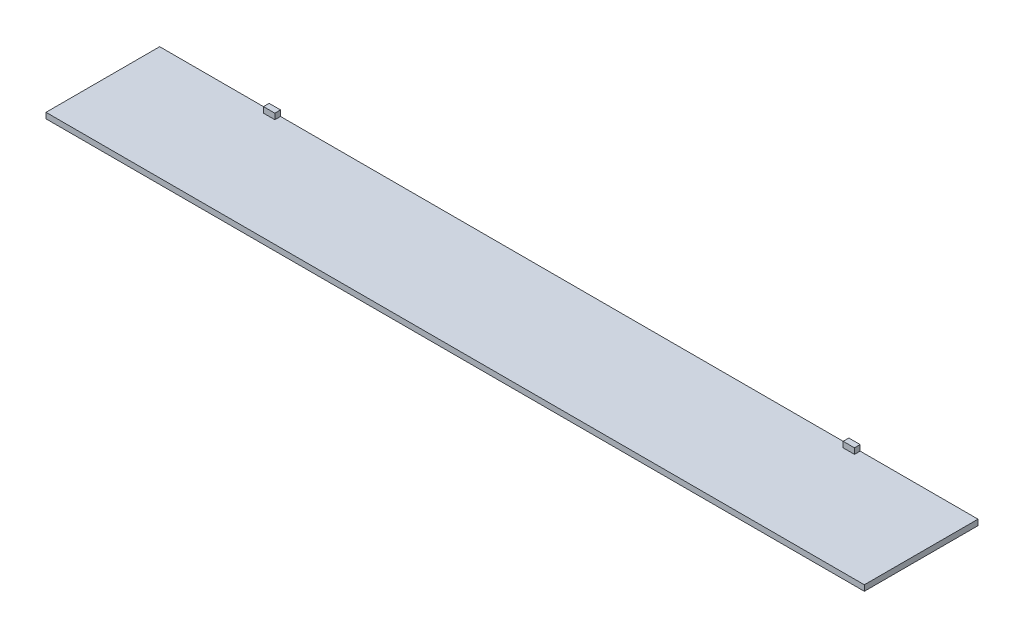
ISO-10303-21;
HEADER;
FILE_DESCRIPTION(('STEP AP214'),'2;1');
FILE_NAME('part.step','',(''),(''),'','','');
FILE_SCHEMA(('AUTOMOTIVE_DESIGN { 1 0 10303 214 1 1 1 1 }'));
ENDSEC;
DATA;
#1=APPLICATION_CONTEXT('core data for automotive mechanical design processes');
#2=APPLICATION_PROTOCOL_DEFINITION('international standard','automotive_design',2000,#1);
#3=PRODUCT_CONTEXT('',#1,'mechanical');
#4=PRODUCT('Part','Part','',(#3));
#5=PRODUCT_RELATED_PRODUCT_CATEGORY('part','',(#4));
#6=PRODUCT_DEFINITION_FORMATION('','',#4);
#7=PRODUCT_DEFINITION_CONTEXT('part definition',#1,'design');
#8=PRODUCT_DEFINITION('design','',#6,#7);
#9=PRODUCT_DEFINITION_SHAPE('','',#8);
#10=(LENGTH_UNIT() NAMED_UNIT(*) SI_UNIT(.MILLI.,.METRE.));
#11=(NAMED_UNIT(*) PLANE_ANGLE_UNIT() SI_UNIT($,.RADIAN.));
#12=(NAMED_UNIT(*) SI_UNIT($,.STERADIAN.) SOLID_ANGLE_UNIT());
#13=UNCERTAINTY_MEASURE_WITH_UNIT(LENGTH_MEASURE(1.E-05),#10,'distance_accuracy_value','');
#14=(GEOMETRIC_REPRESENTATION_CONTEXT(3) GLOBAL_UNCERTAINTY_ASSIGNED_CONTEXT((#13)) GLOBAL_UNIT_ASSIGNED_CONTEXT((#10,
#11,#12)) REPRESENTATION_CONTEXT('',''));
#15=CARTESIAN_POINT('',(0.,0.,0.));
#16=DIRECTION('',(0.,0.,1.));
#17=DIRECTION('',(1.,0.,0.));
#18=AXIS2_PLACEMENT_3D('',#15,#16,#17);
#19=CARTESIAN_POINT('',(0.,10.,0.));
#20=DIRECTION('',(0.,-1.,0.));
#21=DIRECTION('',(0.,0.,-1.));
#22=AXIS2_PLACEMENT_3D('',#19,#20,#21);
#23=PLANE('',#22);
#24=DIRECTION('',(0.,0.,1.));
#25=VECTOR('',#24,1.);
#26=CARTESIAN_POINT('',(492.66,10.,-90.));
#27=LINE('',#26,#25);
#28=CARTESIAN_POINT('',(492.659999999999,10.,-100.000000000002));
#29=VERTEX_POINT('',#28);
#30=CARTESIAN_POINT('',(492.66,10.,-90.));
#31=VERTEX_POINT('',#30);
#32=EDGE_CURVE('E144',#29,#31,#27,.T.);
#33=ORIENTED_EDGE('',*,*,#32,.F.);
#34=DIRECTION('',(-1.,0.,0.));
#35=VECTOR('',#34,1.);
#36=CARTESIAN_POINT('',(-720.,10.,-100.));
#37=LINE('',#36,#35);
#38=CARTESIAN_POINT('',(-507.340000000001,10.,-100.));
#39=VERTEX_POINT('',#38);
#40=EDGE_CURVE('E189',#29,#39,#37,.T.);
#41=ORIENTED_EDGE('',*,*,#40,.T.);
#42=DIRECTION('',(0.,0.,-1.));
#43=VECTOR('',#42,1.);
#44=CARTESIAN_POINT('',(-507.34,10.,-90.0000000000016));
#45=LINE('',#44,#43);
#46=CARTESIAN_POINT('',(-507.34,10.,-90.0000000000016));
#47=VERTEX_POINT('',#46);
#48=EDGE_CURVE('E158',#47,#39,#45,.T.);
#49=ORIENTED_EDGE('',*,*,#48,.F.);
#50=DIRECTION('',(1.,0.,0.));
#51=VECTOR('',#50,1.);
#52=CARTESIAN_POINT('',(-507.34,10.,-90.0000000000016));
#53=LINE('',#52,#51);
#54=CARTESIAN_POINT('',(-527.340000000002,10.,-90.0000000000016));
#55=VERTEX_POINT('',#54);
#56=EDGE_CURVE('E148',#55,#47,#53,.T.);
#57=ORIENTED_EDGE('',*,*,#56,.F.);
#58=DIRECTION('',(0.,0.,1.));
#59=VECTOR('',#58,1.);
#60=CARTESIAN_POINT('',(-527.340000000002,10.,-90.0000000000016));
#61=LINE('',#60,#59);
#62=CARTESIAN_POINT('',(-527.340000000002,10.,-100.));
#63=VERTEX_POINT('',#62);
#64=EDGE_CURVE('E145',#63,#55,#61,.T.);
#65=ORIENTED_EDGE('',*,*,#64,.F.);
#66=CARTESIAN_POINT('',(-720.,10.,-100.));
#67=VERTEX_POINT('',#66);
#68=EDGE_CURVE('E184',#63,#67,#37,.T.);
#69=ORIENTED_EDGE('',*,*,#68,.T.);
#70=DIRECTION('',(0.,0.,1.));
#71=VECTOR('',#70,1.);
#72=CARTESIAN_POINT('',(-720.,10.,100.));
#73=LINE('',#72,#71);
#74=CARTESIAN_POINT('',(-720.,10.,100.));
#75=VERTEX_POINT('',#74);
#76=EDGE_CURVE('E188',#67,#75,#73,.T.);
#77=ORIENTED_EDGE('',*,*,#76,.T.);
#78=DIRECTION('',(1.,0.,0.));
#79=VECTOR('',#78,1.);
#80=CARTESIAN_POINT('',(-720.,10.,100.));
#81=LINE('',#80,#79);
#82=CARTESIAN_POINT('',(720.,10.,100.));
#83=VERTEX_POINT('',#82);
#84=EDGE_CURVE('E191',#75,#83,#81,.T.);
#85=ORIENTED_EDGE('',*,*,#84,.T.);
#86=DIRECTION('',(0.,0.,-1.));
#87=VECTOR('',#86,1.);
#88=CARTESIAN_POINT('',(720.,10.,100.));
#89=LINE('',#88,#87);
#90=CARTESIAN_POINT('',(720.,10.,-100.));
#91=VERTEX_POINT('',#90);
#92=EDGE_CURVE('E181',#83,#91,#89,.T.);
#93=ORIENTED_EDGE('',*,*,#92,.T.);
#94=CARTESIAN_POINT('',(512.659999999999,10.,-100.));
#95=VERTEX_POINT('',#94);
#96=EDGE_CURVE('E186',#91,#95,#37,.T.);
#97=ORIENTED_EDGE('',*,*,#96,.T.);
#98=DIRECTION('',(0.,0.,-1.));
#99=VECTOR('',#98,1.);
#100=CARTESIAN_POINT('',(512.659999999999,10.,-90.));
#101=LINE('',#100,#99);
#102=CARTESIAN_POINT('',(512.659999999999,10.,-90.));
#103=VERTEX_POINT('',#102);
#104=EDGE_CURVE('E55',#103,#95,#101,.T.);
#105=ORIENTED_EDGE('',*,*,#104,.F.);
#106=DIRECTION('',(1.,0.,0.));
#107=VECTOR('',#106,1.);
#108=CARTESIAN_POINT('',(512.659999999999,10.,-90.));
#109=LINE('',#108,#107);
#110=EDGE_CURVE('E50',#31,#103,#109,.T.);
#111=ORIENTED_EDGE('',*,*,#110,.F.);
#112=EDGE_LOOP('',(#33,#41,#49,#57,#65,#69,#77,#85,#93,#97,#105,#111));
#113=FACE_BOUND('',#112,.T.);
#114=ADVANCED_FACE('F35',(#113),#23,.F.);
#115=CARTESIAN_POINT('',(720.,10.,100.));
#116=DIRECTION('',(-1.,0.,0.));
#117=DIRECTION('',(0.,0.,1.));
#118=AXIS2_PLACEMENT_3D('',#115,#116,#117);
#119=PLANE('',#118);
#120=DIRECTION('',(0.,0.,-1.));
#121=VECTOR('',#120,1.);
#122=CARTESIAN_POINT('',(720.,0.,100.));
#123=LINE('',#122,#121);
#124=CARTESIAN_POINT('',(720.,0.,100.));
#125=VERTEX_POINT('',#124);
#126=CARTESIAN_POINT('',(720.,0.,-100.));
#127=VERTEX_POINT('',#126);
#128=EDGE_CURVE('E180',#125,#127,#123,.T.);
#129=ORIENTED_EDGE('',*,*,#128,.T.);
#130=DIRECTION('',(0.,-1.,0.));
#131=VECTOR('',#130,1.);
#132=CARTESIAN_POINT('',(720.,10.,-100.));
#133=LINE('',#132,#131);
#134=EDGE_CURVE('E11',#91,#127,#133,.T.);
#135=ORIENTED_EDGE('',*,*,#134,.F.);
#136=ORIENTED_EDGE('',*,*,#92,.F.);
#137=DIRECTION('',(0.,-1.,0.));
#138=VECTOR('',#137,1.);
#139=CARTESIAN_POINT('',(720.,10.,100.));
#140=LINE('',#139,#138);
#141=EDGE_CURVE('E193',#83,#125,#140,.T.);
#142=ORIENTED_EDGE('',*,*,#141,.T.);
#143=EDGE_LOOP('',(#129,#135,#136,#142));
#144=FACE_BOUND('',#143,.T.);
#145=ADVANCED_FACE('F37',(#144),#119,.F.);
#146=CARTESIAN_POINT('',(-720.,10.,-100.));
#147=DIRECTION('',(0.,0.,1.));
#148=DIRECTION('',(1.,0.,0.));
#149=AXIS2_PLACEMENT_3D('',#146,#147,#148);
#150=PLANE('',#149);
#151=DIRECTION('',(-1.,0.,0.));
#152=VECTOR('',#151,1.);
#153=CARTESIAN_POINT('',(-720.,0.,-100.));
#154=LINE('',#153,#152);
#155=CARTESIAN_POINT('',(-720.,0.,-100.));
#156=VERTEX_POINT('',#155);
#157=EDGE_CURVE('E196',#127,#156,#154,.T.);
#158=ORIENTED_EDGE('',*,*,#157,.T.);
#159=DIRECTION('',(0.,-1.,0.));
#160=VECTOR('',#159,1.);
#161=CARTESIAN_POINT('',(-720.,10.,-100.));
#162=LINE('',#161,#160);
#163=EDGE_CURVE('E43',#67,#156,#162,.T.);
#164=ORIENTED_EDGE('',*,*,#163,.F.);
#165=ORIENTED_EDGE('',*,*,#68,.F.);
#166=DIRECTION('',(0.,-1.,0.));
#167=VECTOR('',#166,1.);
#168=CARTESIAN_POINT('',(-527.340000000002,20.,-100.000000000002));
#169=LINE('',#168,#167);
#170=CARTESIAN_POINT('',(-527.340000000002,20.,-100.000000000002));
#171=VERTEX_POINT('',#170);
#172=EDGE_CURVE('E163',#171,#63,#169,.T.);
#173=ORIENTED_EDGE('',*,*,#172,.F.);
#174=DIRECTION('',(-1.,0.,0.));
#175=VECTOR('',#174,1.);
#176=CARTESIAN_POINT('',(-507.340000000001,20.,-100.000000000002));
#177=LINE('',#176,#175);
#178=CARTESIAN_POINT('',(-507.340000000001,20.,-100.000000000002));
#179=VERTEX_POINT('',#178);
#180=EDGE_CURVE('E162',#179,#171,#177,.T.);
#181=ORIENTED_EDGE('',*,*,#180,.F.);
#182=DIRECTION('',(0.,-1.,0.));
#183=VECTOR('',#182,1.);
#184=CARTESIAN_POINT('',(-507.340000000001,20.,-100.000000000002));
#185=LINE('',#184,#183);
#186=EDGE_CURVE('E171',#179,#39,#185,.T.);
#187=ORIENTED_EDGE('',*,*,#186,.T.);
#188=ORIENTED_EDGE('',*,*,#40,.F.);
#189=DIRECTION('',(0.,-1.,0.));
#190=VECTOR('',#189,1.);
#191=CARTESIAN_POINT('',(492.659999999999,20.,-100.000000000002));
#192=LINE('',#191,#190);
#193=CARTESIAN_POINT('',(492.659999999999,20.,-100.000000000002));
#194=VERTEX_POINT('',#193);
#195=EDGE_CURVE('E355',#194,#29,#192,.T.);
#196=ORIENTED_EDGE('',*,*,#195,.F.);
#197=DIRECTION('',(-1.,0.,0.));
#198=VECTOR('',#197,1.);
#199=CARTESIAN_POINT('',(512.659999999999,20.,-100.000000000002));
#200=LINE('',#199,#198);
#201=CARTESIAN_POINT('',(512.659999999999,20.,-100.000000000002));
#202=VERTEX_POINT('',#201);
#203=EDGE_CURVE('E138',#202,#194,#200,.T.);
#204=ORIENTED_EDGE('',*,*,#203,.F.);
#205=DIRECTION('',(0.,-1.,0.));
#206=VECTOR('',#205,1.);
#207=CARTESIAN_POINT('',(512.659999999999,20.,-100.000000000002));
#208=LINE('',#207,#206);
#209=EDGE_CURVE('E150',#202,#95,#208,.T.);
#210=ORIENTED_EDGE('',*,*,#209,.T.);
#211=ORIENTED_EDGE('',*,*,#96,.F.);
#212=ORIENTED_EDGE('',*,*,#134,.T.);
#213=EDGE_LOOP('',(#158,#164,#165,#173,#181,#187,#188,#196,#204,#210,#211,#212));
#214=FACE_BOUND('',#213,.T.);
#215=ADVANCED_FACE('F232',(#214),#150,.F.);
#216=CARTESIAN_POINT('',(-720.,10.,100.));
#217=DIRECTION('',(1.,0.,0.));
#218=DIRECTION('',(0.,0.,-1.));
#219=AXIS2_PLACEMENT_3D('',#216,#217,#218);
#220=PLANE('',#219);
#221=DIRECTION('',(0.,0.,1.));
#222=VECTOR('',#221,1.);
#223=CARTESIAN_POINT('',(-720.,0.,100.));
#224=LINE('',#223,#222);
#225=CARTESIAN_POINT('',(-720.,0.,100.));
#226=VERTEX_POINT('',#225);
#227=EDGE_CURVE('E198',#156,#226,#224,.T.);
#228=ORIENTED_EDGE('',*,*,#227,.T.);
#229=DIRECTION('',(0.,-1.,0.));
#230=VECTOR('',#229,1.);
#231=CARTESIAN_POINT('',(-720.,10.,100.));
#232=LINE('',#231,#230);
#233=EDGE_CURVE('E203',#75,#226,#232,.T.);
#234=ORIENTED_EDGE('',*,*,#233,.F.);
#235=ORIENTED_EDGE('',*,*,#76,.F.);
#236=ORIENTED_EDGE('',*,*,#163,.T.);
#237=EDGE_LOOP('',(#228,#234,#235,#236));
#238=FACE_BOUND('',#237,.T.);
#239=ADVANCED_FACE('F210',(#238),#220,.F.);
#240=CARTESIAN_POINT('',(-720.,10.,100.));
#241=DIRECTION('',(0.,0.,-1.));
#242=DIRECTION('',(-1.,0.,0.));
#243=AXIS2_PLACEMENT_3D('',#240,#241,#242);
#244=PLANE('',#243);
#245=DIRECTION('',(1.,0.,0.));
#246=VECTOR('',#245,1.);
#247=CARTESIAN_POINT('',(-720.,0.,100.));
#248=LINE('',#247,#246);
#249=EDGE_CURVE('E185',#226,#125,#248,.T.);
#250=ORIENTED_EDGE('',*,*,#249,.T.);
#251=ORIENTED_EDGE('',*,*,#141,.F.);
#252=ORIENTED_EDGE('',*,*,#84,.F.);
#253=ORIENTED_EDGE('',*,*,#233,.T.);
#254=EDGE_LOOP('',(#250,#251,#252,#253));
#255=FACE_BOUND('',#254,.T.);
#256=ADVANCED_FACE('F220',(#255),#244,.F.);
#257=CARTESIAN_POINT('',(0.,0.,0.));
#258=DIRECTION('',(0.,-1.,0.));
#259=DIRECTION('',(0.,0.,-1.));
#260=AXIS2_PLACEMENT_3D('',#257,#258,#259);
#261=PLANE('',#260);
#262=ORIENTED_EDGE('',*,*,#128,.F.);
#263=ORIENTED_EDGE('',*,*,#249,.F.);
#264=ORIENTED_EDGE('',*,*,#227,.F.);
#265=ORIENTED_EDGE('',*,*,#157,.F.);
#266=EDGE_LOOP('',(#262,#263,#264,#265));
#267=FACE_BOUND('',#266,.T.);
#268=ADVANCED_FACE('F217',(#267),#261,.T.);
#269=CARTESIAN_POINT('',(-527.340000000002,20.,-90.0000000000016));
#270=DIRECTION('',(1.,0.,0.));
#271=DIRECTION('',(0.,0.,-1.));
#272=AXIS2_PLACEMENT_3D('',#269,#270,#271);
#273=PLANE('',#272);
#274=ORIENTED_EDGE('',*,*,#64,.T.);
#275=DIRECTION('',(0.,-1.,0.));
#276=VECTOR('',#275,1.);
#277=CARTESIAN_POINT('',(-527.340000000002,20.,-90.0000000000016));
#278=LINE('',#277,#276);
#279=CARTESIAN_POINT('',(-527.340000000002,20.,-90.0000000000016));
#280=VERTEX_POINT('',#279);
#281=EDGE_CURVE('E177',#280,#55,#278,.T.);
#282=ORIENTED_EDGE('',*,*,#281,.F.);
#283=DIRECTION('',(0.,0.,1.));
#284=VECTOR('',#283,1.);
#285=CARTESIAN_POINT('',(-527.340000000002,20.,-90.0000000000016));
#286=LINE('',#285,#284);
#287=EDGE_CURVE('E154',#171,#280,#286,.T.);
#288=ORIENTED_EDGE('',*,*,#287,.F.);
#289=ORIENTED_EDGE('',*,*,#172,.T.);
#290=EDGE_LOOP('',(#274,#282,#288,#289));
#291=FACE_BOUND('',#290,.T.);
#292=ADVANCED_FACE('F240',(#291),#273,.F.);
#293=CARTESIAN_POINT('',(-507.34,20.,-90.0000000000016));
#294=DIRECTION('',(0.,0.,-1.));
#295=DIRECTION('',(-1.,0.,0.));
#296=AXIS2_PLACEMENT_3D('',#293,#294,#295);
#297=PLANE('',#296);
#298=ORIENTED_EDGE('',*,*,#56,.T.);
#299=DIRECTION('',(0.,-1.,0.));
#300=VECTOR('',#299,1.);
#301=CARTESIAN_POINT('',(-507.34,20.,-90.0000000000016));
#302=LINE('',#301,#300);
#303=CARTESIAN_POINT('',(-507.34,20.,-90.0000000000016));
#304=VERTEX_POINT('',#303);
#305=EDGE_CURVE('E174',#304,#47,#302,.T.);
#306=ORIENTED_EDGE('',*,*,#305,.F.);
#307=DIRECTION('',(1.,0.,0.));
#308=VECTOR('',#307,1.);
#309=CARTESIAN_POINT('',(-507.34,20.,-90.0000000000016));
#310=LINE('',#309,#308);
#311=EDGE_CURVE('E157',#280,#304,#310,.T.);
#312=ORIENTED_EDGE('',*,*,#311,.F.);
#313=ORIENTED_EDGE('',*,*,#281,.T.);
#314=EDGE_LOOP('',(#298,#306,#312,#313));
#315=FACE_BOUND('',#314,.T.);
#316=ADVANCED_FACE('F238',(#315),#297,.F.);
#317=CARTESIAN_POINT('',(-507.34,20.,-90.0000000000016));
#318=DIRECTION('',(-1.,0.,0.));
#319=DIRECTION('',(0.,0.,1.));
#320=AXIS2_PLACEMENT_3D('',#317,#318,#319);
#321=PLANE('',#320);
#322=ORIENTED_EDGE('',*,*,#48,.T.);
#323=ORIENTED_EDGE('',*,*,#186,.F.);
#324=DIRECTION('',(0.,0.,-1.));
#325=VECTOR('',#324,1.);
#326=CARTESIAN_POINT('',(-507.34,20.,-90.0000000000016));
#327=LINE('',#326,#325);
#328=EDGE_CURVE('E160',#304,#179,#327,.T.);
#329=ORIENTED_EDGE('',*,*,#328,.F.);
#330=ORIENTED_EDGE('',*,*,#305,.T.);
#331=EDGE_LOOP('',(#322,#323,#329,#330));
#332=FACE_BOUND('',#331,.T.);
#333=ADVANCED_FACE('F228',(#332),#321,.F.);
#334=CARTESIAN_POINT('',(0.,20.,0.));
#335=DIRECTION('',(0.,1.,0.));
#336=DIRECTION('',(0.,0.,1.));
#337=AXIS2_PLACEMENT_3D('',#334,#335,#336);
#338=PLANE('',#337);
#339=ORIENTED_EDGE('',*,*,#287,.T.);
#340=ORIENTED_EDGE('',*,*,#311,.T.);
#341=ORIENTED_EDGE('',*,*,#328,.T.);
#342=ORIENTED_EDGE('',*,*,#180,.T.);
#343=EDGE_LOOP('',(#339,#340,#341,#342));
#344=FACE_BOUND('',#343,.T.);
#345=ADVANCED_FACE('F235',(#344),#338,.T.);
#346=CARTESIAN_POINT('',(492.66,20.,-90.));
#347=DIRECTION('',(1.,0.,0.));
#348=DIRECTION('',(0.,0.,-1.));
#349=AXIS2_PLACEMENT_3D('',#346,#347,#348);
#350=PLANE('',#349);
#351=ORIENTED_EDGE('',*,*,#32,.T.);
#352=DIRECTION('',(0.,-1.,0.));
#353=VECTOR('',#352,1.);
#354=CARTESIAN_POINT('',(492.66,20.,-90.));
#355=LINE('',#354,#353);
#356=CARTESIAN_POINT('',(492.66,20.,-90.));
#357=VERTEX_POINT('',#356);
#358=EDGE_CURVE('E126',#357,#31,#355,.T.);
#359=ORIENTED_EDGE('',*,*,#358,.F.);
#360=DIRECTION('',(0.,0.,1.));
#361=VECTOR('',#360,1.);
#362=CARTESIAN_POINT('',(492.66,20.,-90.));
#363=LINE('',#362,#361);
#364=EDGE_CURVE('E133',#194,#357,#363,.T.);
#365=ORIENTED_EDGE('',*,*,#364,.F.);
#366=ORIENTED_EDGE('',*,*,#195,.T.);
#367=EDGE_LOOP('',(#351,#359,#365,#366));
#368=FACE_BOUND('',#367,.T.);
#369=ADVANCED_FACE('F143',(#368),#350,.F.);
#370=CARTESIAN_POINT('',(512.659999999999,20.,-90.));
#371=DIRECTION('',(0.,0.,-1.));
#372=DIRECTION('',(-1.,0.,0.));
#373=AXIS2_PLACEMENT_3D('',#370,#371,#372);
#374=PLANE('',#373);
#375=ORIENTED_EDGE('',*,*,#110,.T.);
#376=DIRECTION('',(0.,-1.,0.));
#377=VECTOR('',#376,1.);
#378=CARTESIAN_POINT('',(512.659999999999,20.,-90.));
#379=LINE('',#378,#377);
#380=CARTESIAN_POINT('',(512.659999999999,20.,-90.));
#381=VERTEX_POINT('',#380);
#382=EDGE_CURVE('E129',#381,#103,#379,.T.);
#383=ORIENTED_EDGE('',*,*,#382,.F.);
#384=DIRECTION('',(1.,0.,0.));
#385=VECTOR('',#384,1.);
#386=CARTESIAN_POINT('',(512.659999999999,20.,-90.));
#387=LINE('',#386,#385);
#388=EDGE_CURVE('E122',#357,#381,#387,.T.);
#389=ORIENTED_EDGE('',*,*,#388,.F.);
#390=ORIENTED_EDGE('',*,*,#358,.T.);
#391=EDGE_LOOP('',(#375,#383,#389,#390));
#392=FACE_BOUND('',#391,.T.);
#393=ADVANCED_FACE('F124',(#392),#374,.F.);
#394=CARTESIAN_POINT('',(512.659999999999,20.,-90.));
#395=DIRECTION('',(-1.,0.,0.));
#396=DIRECTION('',(0.,0.,1.));
#397=AXIS2_PLACEMENT_3D('',#394,#395,#396);
#398=PLANE('',#397);
#399=ORIENTED_EDGE('',*,*,#104,.T.);
#400=ORIENTED_EDGE('',*,*,#209,.F.);
#401=DIRECTION('',(0.,0.,-1.));
#402=VECTOR('',#401,1.);
#403=CARTESIAN_POINT('',(512.659999999999,20.,-90.));
#404=LINE('',#403,#402);
#405=EDGE_CURVE('E132',#381,#202,#404,.T.);
#406=ORIENTED_EDGE('',*,*,#405,.F.);
#407=ORIENTED_EDGE('',*,*,#382,.T.);
#408=EDGE_LOOP('',(#399,#400,#406,#407));
#409=FACE_BOUND('',#408,.T.);
#410=ADVANCED_FACE('F328',(#409),#398,.F.);
#411=CARTESIAN_POINT('',(0.,20.,0.));
#412=DIRECTION('',(0.,1.,0.));
#413=DIRECTION('',(0.,0.,1.));
#414=AXIS2_PLACEMENT_3D('',#411,#412,#413);
#415=PLANE('',#414);
#416=ORIENTED_EDGE('',*,*,#364,.T.);
#417=ORIENTED_EDGE('',*,*,#388,.T.);
#418=ORIENTED_EDGE('',*,*,#405,.T.);
#419=ORIENTED_EDGE('',*,*,#203,.T.);
#420=EDGE_LOOP('',(#416,#417,#418,#419));
#421=FACE_BOUND('',#420,.T.);
#422=ADVANCED_FACE('F136',(#421),#415,.T.);
#423=CLOSED_SHELL('',(#114,#145,#215,#239,#256,#268,#292,#316,#333,#345,#369,#393,#410,#422));
#424=MANIFOLD_SOLID_BREP('B2',#423);
#425=ADVANCED_BREP_SHAPE_REPRESENTATION('',(#18,#424),#14);
#426=SHAPE_DEFINITION_REPRESENTATION(#9,#425);
ENDSEC;
END-ISO-10303-21;
